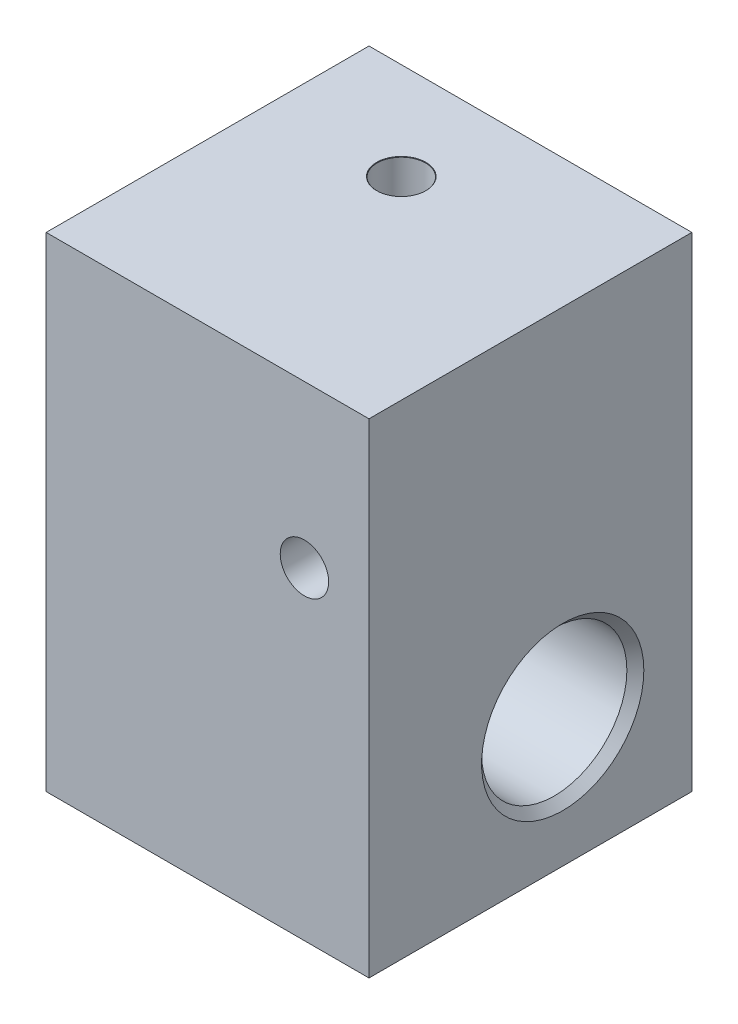
ISO-10303-21;
HEADER;
FILE_DESCRIPTION(('STEP AP214'),'2;1');
FILE_NAME('part.step','',(''),(''),'','','');
FILE_SCHEMA(('AUTOMOTIVE_DESIGN { 1 0 10303 214 1 1 1 1 }'));
ENDSEC;
DATA;
#1=APPLICATION_CONTEXT('core data for automotive mechanical design processes');
#2=APPLICATION_PROTOCOL_DEFINITION('international standard','automotive_design',2000,#1);
#3=PRODUCT_CONTEXT('',#1,'mechanical');
#4=PRODUCT('Part','Part','',(#3));
#5=PRODUCT_RELATED_PRODUCT_CATEGORY('part','',(#4));
#6=PRODUCT_DEFINITION_FORMATION('','',#4);
#7=PRODUCT_DEFINITION_CONTEXT('part definition',#1,'design');
#8=PRODUCT_DEFINITION('design','',#6,#7);
#9=PRODUCT_DEFINITION_SHAPE('','',#8);
#10=(LENGTH_UNIT() NAMED_UNIT(*) SI_UNIT(.MILLI.,.METRE.));
#11=(NAMED_UNIT(*) PLANE_ANGLE_UNIT() SI_UNIT($,.RADIAN.));
#12=(NAMED_UNIT(*) SI_UNIT($,.STERADIAN.) SOLID_ANGLE_UNIT());
#13=UNCERTAINTY_MEASURE_WITH_UNIT(LENGTH_MEASURE(1.E-05),#10,'distance_accuracy_value','');
#14=(GEOMETRIC_REPRESENTATION_CONTEXT(3) GLOBAL_UNCERTAINTY_ASSIGNED_CONTEXT((#13)) GLOBAL_UNIT_ASSIGNED_CONTEXT((#10,
#11,#12)) REPRESENTATION_CONTEXT('',''));
#15=CARTESIAN_POINT('',(0.,0.,0.));
#16=DIRECTION('',(0.,0.,1.));
#17=DIRECTION('',(1.,0.,0.));
#18=AXIS2_PLACEMENT_3D('',#15,#16,#17);
#19=CARTESIAN_POINT('',(0.,30.,-1.9004617207274));
#20=DIRECTION('',(1.,0.,0.));
#21=DIRECTION('',(0.,0.,-1.));
#22=AXIS2_PLACEMENT_3D('',#19,#20,#21);
#23=PLANE('',#22);
#24=CARTESIAN_POINT('',(0.,20.,10.0995382792726));
#25=DIRECTION('',(-1.,0.,0.));
#26=DIRECTION('',(0.,0.,1.));
#27=AXIS2_PLACEMENT_3D('',#24,#25,#26);
#28=CIRCLE('',#27,1.525);
#29=CARTESIAN_POINT('',(0.,20.,11.6245382792726));
#30=VERTEX_POINT('',#29);
#31=EDGE_CURVE('E116',#30,#30,#28,.T.);
#32=ORIENTED_EDGE('',*,*,#31,.F.);
#33=EDGE_LOOP('',(#32));
#34=FACE_BOUND('',#33,.T.);
#35=DIRECTION('',(0.,0.,1.));
#36=VECTOR('',#35,1.);
#37=CARTESIAN_POINT('',(0.,0.,-1.9004617207274));
#38=LINE('',#37,#36);
#39=CARTESIAN_POINT('',(0.,0.,-1.9004617207274));
#40=VERTEX_POINT('',#39);
#41=CARTESIAN_POINT('',(0.,0.,18.0995382792726));
#42=VERTEX_POINT('',#41);
#43=EDGE_CURVE('E134',#40,#42,#38,.T.);
#44=ORIENTED_EDGE('',*,*,#43,.T.);
#45=DIRECTION('',(0.,-1.,0.));
#46=VECTOR('',#45,1.);
#47=CARTESIAN_POINT('',(0.,30.,18.0995382792726));
#48=LINE('',#47,#46);
#49=CARTESIAN_POINT('',(0.,30.,18.0995382792726));
#50=VERTEX_POINT('',#49);
#51=EDGE_CURVE('E11',#50,#42,#48,.T.);
#52=ORIENTED_EDGE('',*,*,#51,.F.);
#53=DIRECTION('',(0.,0.,1.));
#54=VECTOR('',#53,1.);
#55=CARTESIAN_POINT('',(0.,30.,-1.9004617207274));
#56=LINE('',#55,#54);
#57=CARTESIAN_POINT('',(0.,30.,-1.9004617207274));
#58=VERTEX_POINT('',#57);
#59=EDGE_CURVE('E135',#58,#50,#56,.T.);
#60=ORIENTED_EDGE('',*,*,#59,.F.);
#61=DIRECTION('',(0.,-1.,0.));
#62=VECTOR('',#61,1.);
#63=CARTESIAN_POINT('',(0.,30.,-1.9004617207274));
#64=LINE('',#63,#62);
#65=EDGE_CURVE('E141',#58,#40,#64,.T.);
#66=ORIENTED_EDGE('',*,*,#65,.T.);
#67=EDGE_LOOP('',(#44,#52,#60,#66));
#68=FACE_BOUND('',#67,.T.);
#69=ADVANCED_FACE('F32',(#34,#68),#23,.F.);
#70=CARTESIAN_POINT('',(0.,30.,18.0995382792726));
#71=DIRECTION('',(0.,0.,-1.));
#72=DIRECTION('',(-1.,0.,0.));
#73=AXIS2_PLACEMENT_3D('',#70,#71,#72);
#74=PLANE('',#73);
#75=CARTESIAN_POINT('',(16.,20.,18.0995382792726));
#76=DIRECTION('',(0.,0.,-1.));
#77=DIRECTION('',(-1.,0.,0.));
#78=AXIS2_PLACEMENT_3D('',#75,#76,#77);
#79=CIRCLE('',#78,1.5);
#80=CARTESIAN_POINT('',(14.5,20.,18.0995382792726));
#81=VERTEX_POINT('',#80);
#82=EDGE_CURVE('E131',#81,#81,#79,.T.);
#83=ORIENTED_EDGE('',*,*,#82,.T.);
#84=EDGE_LOOP('',(#83));
#85=FACE_BOUND('',#84,.T.);
#86=DIRECTION('',(1.,0.,0.));
#87=VECTOR('',#86,1.);
#88=CARTESIAN_POINT('',(0.,0.,18.0995382792726));
#89=LINE('',#88,#87);
#90=CARTESIAN_POINT('',(20.,0.,18.0995382792726));
#91=VERTEX_POINT('',#90);
#92=EDGE_CURVE('E144',#42,#91,#89,.T.);
#93=ORIENTED_EDGE('',*,*,#92,.T.);
#94=DIRECTION('',(0.,-1.,0.));
#95=VECTOR('',#94,1.);
#96=CARTESIAN_POINT('',(20.,30.,18.0995382792726));
#97=LINE('',#96,#95);
#98=CARTESIAN_POINT('',(20.,30.,18.0995382792726));
#99=VERTEX_POINT('',#98);
#100=EDGE_CURVE('E46',#99,#91,#97,.T.);
#101=ORIENTED_EDGE('',*,*,#100,.F.);
#102=DIRECTION('',(1.,0.,0.));
#103=VECTOR('',#102,1.);
#104=CARTESIAN_POINT('',(0.,30.,18.0995382792726));
#105=LINE('',#104,#103);
#106=EDGE_CURVE('E85',#50,#99,#105,.T.);
#107=ORIENTED_EDGE('',*,*,#106,.F.);
#108=ORIENTED_EDGE('',*,*,#51,.T.);
#109=EDGE_LOOP('',(#93,#101,#107,#108));
#110=FACE_BOUND('',#109,.T.);
#111=ADVANCED_FACE('F170',(#85,#110),#74,.F.);
#112=CARTESIAN_POINT('',(20.,30.,-1.9004617207274));
#113=DIRECTION('',(-1.,0.,0.));
#114=DIRECTION('',(0.,0.,1.));
#115=AXIS2_PLACEMENT_3D('',#112,#113,#114);
#116=PLANE('',#115);
#117=CARTESIAN_POINT('',(20.,8.,6.0995382792726));
#118=DIRECTION('',(1.,0.,0.));
#119=DIRECTION('',(0.,0.,-1.));
#120=AXIS2_PLACEMENT_3D('',#117,#118,#119);
#121=CIRCLE('',#120,5.025);
#122=CARTESIAN_POINT('',(20.,8.,1.07453827927259));
#123=VERTEX_POINT('',#122);
#124=EDGE_CURVE('E107',#123,#123,#121,.T.);
#125=ORIENTED_EDGE('',*,*,#124,.F.);
#126=EDGE_LOOP('',(#125));
#127=FACE_BOUND('',#126,.T.);
#128=DIRECTION('',(0.,0.,-1.));
#129=VECTOR('',#128,1.);
#130=CARTESIAN_POINT('',(20.,0.,-1.9004617207274));
#131=LINE('',#130,#129);
#132=CARTESIAN_POINT('',(20.,0.,-1.9004617207274));
#133=VERTEX_POINT('',#132);
#134=EDGE_CURVE('E72',#91,#133,#131,.T.);
#135=ORIENTED_EDGE('',*,*,#134,.T.);
#136=DIRECTION('',(0.,-1.,0.));
#137=VECTOR('',#136,1.);
#138=CARTESIAN_POINT('',(20.,30.,-1.9004617207274));
#139=LINE('',#138,#137);
#140=CARTESIAN_POINT('',(20.,30.,-1.9004617207274));
#141=VERTEX_POINT('',#140);
#142=EDGE_CURVE('E149',#141,#133,#139,.T.);
#143=ORIENTED_EDGE('',*,*,#142,.F.);
#144=DIRECTION('',(0.,0.,-1.));
#145=VECTOR('',#144,1.);
#146=CARTESIAN_POINT('',(20.,30.,-1.9004617207274));
#147=LINE('',#146,#145);
#148=EDGE_CURVE('E138',#99,#141,#147,.T.);
#149=ORIENTED_EDGE('',*,*,#148,.F.);
#150=ORIENTED_EDGE('',*,*,#100,.T.);
#151=EDGE_LOOP('',(#135,#143,#149,#150));
#152=FACE_BOUND('',#151,.T.);
#153=ADVANCED_FACE('F152',(#127,#152),#116,.F.);
#154=CARTESIAN_POINT('',(0.,30.,-1.9004617207274));
#155=DIRECTION('',(0.,0.,1.));
#156=DIRECTION('',(1.,0.,0.));
#157=AXIS2_PLACEMENT_3D('',#154,#155,#156);
#158=PLANE('',#157);
#159=CARTESIAN_POINT('',(16.,20.,-1.90046172072741));
#160=DIRECTION('',(0.,0.,-1.));
#161=DIRECTION('',(-1.,0.,0.));
#162=AXIS2_PLACEMENT_3D('',#159,#160,#161);
#163=CIRCLE('',#162,1.525);
#164=CARTESIAN_POINT('',(14.475,20.,-1.90046172072741));
#165=VERTEX_POINT('',#164);
#166=EDGE_CURVE('E125',#165,#165,#163,.T.);
#167=ORIENTED_EDGE('',*,*,#166,.F.);
#168=EDGE_LOOP('',(#167));
#169=FACE_BOUND('',#168,.T.);
#170=DIRECTION('',(-1.,0.,0.));
#171=VECTOR('',#170,1.);
#172=CARTESIAN_POINT('',(0.,0.,-1.9004617207274));
#173=LINE('',#172,#171);
#174=EDGE_CURVE('E78',#133,#40,#173,.T.);
#175=ORIENTED_EDGE('',*,*,#174,.T.);
#176=ORIENTED_EDGE('',*,*,#65,.F.);
#177=DIRECTION('',(-1.,0.,0.));
#178=VECTOR('',#177,1.);
#179=CARTESIAN_POINT('',(0.,30.,-1.9004617207274));
#180=LINE('',#179,#178);
#181=EDGE_CURVE('E54',#141,#58,#180,.T.);
#182=ORIENTED_EDGE('',*,*,#181,.F.);
#183=ORIENTED_EDGE('',*,*,#142,.T.);
#184=EDGE_LOOP('',(#175,#176,#182,#183));
#185=FACE_BOUND('',#184,.T.);
#186=ADVANCED_FACE('F159',(#169,#185),#158,.F.);
#187=CARTESIAN_POINT('',(0.,30.,0.));
#188=DIRECTION('',(0.,1.,0.));
#189=DIRECTION('',(0.,0.,1.));
#190=AXIS2_PLACEMENT_3D('',#187,#188,#189);
#191=PLANE('',#190);
#192=CARTESIAN_POINT('',(8.,30.,4.0995382792726));
#193=DIRECTION('',(0.,1.,0.));
#194=DIRECTION('',(0.,0.,1.));
#195=AXIS2_PLACEMENT_3D('',#192,#193,#194);
#196=CIRCLE('',#195,1.525);
#197=CARTESIAN_POINT('',(8.,30.,5.6245382792726));
#198=VERTEX_POINT('',#197);
#199=EDGE_CURVE('E105',#198,#198,#196,.T.);
#200=ORIENTED_EDGE('',*,*,#199,.F.);
#201=EDGE_LOOP('',(#200));
#202=FACE_BOUND('',#201,.T.);
#203=ORIENTED_EDGE('',*,*,#59,.T.);
#204=ORIENTED_EDGE('',*,*,#106,.T.);
#205=ORIENTED_EDGE('',*,*,#148,.T.);
#206=ORIENTED_EDGE('',*,*,#181,.T.);
#207=EDGE_LOOP('',(#203,#204,#205,#206));
#208=FACE_BOUND('',#207,.T.);
#209=ADVANCED_FACE('F161',(#202,#208),#191,.T.);
#210=CARTESIAN_POINT('',(0.,0.,0.));
#211=DIRECTION('',(0.,1.,0.));
#212=DIRECTION('',(0.,0.,1.));
#213=AXIS2_PLACEMENT_3D('',#210,#211,#212);
#214=PLANE('',#213);
#215=ORIENTED_EDGE('',*,*,#43,.F.);
#216=ORIENTED_EDGE('',*,*,#174,.F.);
#217=ORIENTED_EDGE('',*,*,#134,.F.);
#218=ORIENTED_EDGE('',*,*,#92,.F.);
#219=EDGE_LOOP('',(#215,#216,#217,#218));
#220=FACE_BOUND('',#219,.T.);
#221=ADVANCED_FACE('F155',(#220),#214,.F.);
#222=CARTESIAN_POINT('',(16.,20.,-1.9004617207274));
#223=DIRECTION('',(0.,0.,-1.));
#224=DIRECTION('',(-1.,0.,0.));
#225=AXIS2_PLACEMENT_3D('',#222,#223,#224);
#226=CYLINDRICAL_SURFACE('',#225,1.5);
#227=ORIENTED_EDGE('',*,*,#82,.F.);
#228=EDGE_LOOP('',(#227));
#229=FACE_BOUND('',#228,.T.);
#230=CARTESIAN_POINT('',(16.,20.,-1.8754617207274));
#231=DIRECTION('',(0.,0.,-1.));
#232=DIRECTION('',(-1.,0.,0.));
#233=AXIS2_PLACEMENT_3D('',#230,#231,#232);
#234=CIRCLE('',#233,1.5);
#235=CARTESIAN_POINT('',(14.5,20.,-1.8754617207274));
#236=VERTEX_POINT('',#235);
#237=EDGE_CURVE('E128',#236,#236,#234,.T.);
#238=ORIENTED_EDGE('',*,*,#237,.T.);
#239=EDGE_LOOP('',(#238));
#240=FACE_BOUND('',#239,.T.);
#241=ADVANCED_FACE('F208',(#229,#240),#226,.F.);
#242=CARTESIAN_POINT('',(16.,20.,-1.90046172072741));
#243=DIRECTION('',(0.,0.,-1.));
#244=DIRECTION('',(-1.,0.,0.));
#245=AXIS2_PLACEMENT_3D('',#242,#243,#244);
#246=CONICAL_SURFACE('',#245,1.525,0.785398163397357);
#247=ORIENTED_EDGE('',*,*,#237,.F.);
#248=EDGE_LOOP('',(#247));
#249=FACE_BOUND('',#248,.T.);
#250=ORIENTED_EDGE('',*,*,#166,.T.);
#251=EDGE_LOOP('',(#250));
#252=FACE_BOUND('',#251,.T.);
#253=ADVANCED_FACE('F204',(#249,#252),#246,.F.);
#254=CARTESIAN_POINT('',(12.,20.,10.0995382792726));
#255=DIRECTION('',(-1.,0.,0.));
#256=DIRECTION('',(0.,0.,1.));
#257=AXIS2_PLACEMENT_3D('',#254,#255,#256);
#258=CONICAL_SURFACE('',#257,1.5,1.02974425867665);
#259=CARTESIAN_POINT('',(12.9012909285413,20.,10.0995382792726));
#260=VERTEX_POINT('',#259);
#261=VERTEX_LOOP('',#260);
#262=FACE_BOUND('',#261,.T.);
#263=CARTESIAN_POINT('',(12.,20.,10.0995382792726));
#264=DIRECTION('',(-1.,0.,0.));
#265=DIRECTION('',(0.,0.,1.));
#266=AXIS2_PLACEMENT_3D('',#263,#264,#265);
#267=CIRCLE('',#266,1.5);
#268=CARTESIAN_POINT('',(12.,20.,11.5995382792726));
#269=VERTEX_POINT('',#268);
#270=EDGE_CURVE('E122',#269,#269,#267,.T.);
#271=ORIENTED_EDGE('',*,*,#270,.T.);
#272=EDGE_LOOP('',(#271));
#273=FACE_BOUND('',#272,.T.);
#274=ADVANCED_FACE('F195',(#262,#273),#258,.F.);
#275=CARTESIAN_POINT('',(0.,20.,10.0995382792726));
#276=DIRECTION('',(-1.,0.,0.));
#277=DIRECTION('',(0.,0.,1.));
#278=AXIS2_PLACEMENT_3D('',#275,#276,#277);
#279=CYLINDRICAL_SURFACE('',#278,1.49999999999999);
#280=ORIENTED_EDGE('',*,*,#270,.F.);
#281=EDGE_LOOP('',(#280));
#282=FACE_BOUND('',#281,.T.);
#283=CARTESIAN_POINT('',(0.0250000000000124,20.,10.0995382792726));
#284=DIRECTION('',(-1.,0.,0.));
#285=DIRECTION('',(0.,0.,1.));
#286=AXIS2_PLACEMENT_3D('',#283,#284,#285);
#287=CIRCLE('',#286,1.49999999999999);
#288=CARTESIAN_POINT('',(0.0250000000000125,20.,11.5995382792726));
#289=VERTEX_POINT('',#288);
#290=EDGE_CURVE('E119',#289,#289,#287,.T.);
#291=ORIENTED_EDGE('',*,*,#290,.T.);
#292=EDGE_LOOP('',(#291));
#293=FACE_BOUND('',#292,.T.);
#294=ADVANCED_FACE('F186',(#282,#293),#279,.F.);
#295=CARTESIAN_POINT('',(0.,20.,10.0995382792726));
#296=DIRECTION('',(-1.,0.,0.));
#297=DIRECTION('',(0.,0.,1.));
#298=AXIS2_PLACEMENT_3D('',#295,#296,#297);
#299=CONICAL_SURFACE('',#298,1.525,0.785398163397414);
#300=ORIENTED_EDGE('',*,*,#290,.F.);
#301=EDGE_LOOP('',(#300));
#302=FACE_BOUND('',#301,.T.);
#303=ORIENTED_EDGE('',*,*,#31,.T.);
#304=EDGE_LOOP('',(#303));
#305=FACE_BOUND('',#304,.T.);
#306=ADVANCED_FACE('F183',(#302,#305),#299,.F.);
#307=CARTESIAN_POINT('',(8.,30.,4.0995382792726));
#308=DIRECTION('',(0.,1.,0.));
#309=DIRECTION('',(0.,0.,1.));
#310=AXIS2_PLACEMENT_3D('',#307,#308,#309);
#311=CYLINDRICAL_SURFACE('',#310,1.49999999999999);
#312=CARTESIAN_POINT('',(8.,12.4721359549996,5.59953827927258));
#313=CARTESIAN_POINT('',(7.91660474612497,12.4721374897967,5.59953468171094));
#314=CARTESIAN_POINT('',(7.83310158214307,12.4713722764732,5.59255522103359));
#315=CARTESIAN_POINT('',(7.66833120121543,12.4681368275641,5.56480306938219));
#316=CARTESIAN_POINT('',(7.58706899448924,12.4656630500406,5.54400172837386));
#317=CARTESIAN_POINT('',(7.42924396257842,12.4585049609598,5.48921664185374));
#318=CARTESIAN_POINT('',(7.35267890103656,12.4538217107305,5.45523922690869));
#319=CARTESIAN_POINT('',(7.20647374251181,12.4415014615554,5.37517898503824));
#320=CARTESIAN_POINT('',(7.13682999328285,12.4338660309346,5.32910258977373));
#321=CARTESIAN_POINT('',(7.00687413351858,12.4148432953305,5.22670177567263));
#322=CARTESIAN_POINT('',(6.94650299024569,12.4034813041766,5.17044761767187));
#323=CARTESIAN_POINT('',(6.83621974614194,12.3762006532261,5.04944103916348));
#324=CARTESIAN_POINT('',(6.78630678265046,12.3602823695196,4.98468932030866));
#325=CARTESIAN_POINT('',(6.69860456959045,12.3235171132845,4.84972505648165));
#326=CARTESIAN_POINT('',(6.66069424421065,12.3027233048777,4.77957654589637));
#327=CARTESIAN_POINT('',(6.59687712900855,12.2559171602169,4.63567649205098));
#328=CARTESIAN_POINT('',(6.57097078731713,12.2299046291903,4.56192481439159));
#329=CARTESIAN_POINT('',(6.53064586187609,12.1721299355647,4.41134659027188));
#330=CARTESIAN_POINT('',(6.51652598235153,12.140241923947,4.33448905225095));
#331=CARTESIAN_POINT('',(6.50027622206906,12.0717004771356,4.18165362006912));
#332=CARTESIAN_POINT('',(6.49815135627429,12.0350450552992,4.10567610708142));
#333=CARTESIAN_POINT('',(6.50531066195152,11.9540187291887,3.94913640285375));
#334=CARTESIAN_POINT('',(6.51571205581429,11.9092448204257,3.868836302171));
#335=CARTESIAN_POINT('',(6.54847935348241,11.8160885266045,3.71296566158689));
#336=CARTESIAN_POINT('',(6.57084760530466,11.7677054349923,3.63739605310674));
#337=CARTESIAN_POINT('',(6.63066070404919,11.6608528345316,3.48066604117342));
#338=CARTESIAN_POINT('',(6.66991088046487,11.6019858989318,3.40046751312403));
#339=CARTESIAN_POINT('',(6.76153833030939,11.4830216515266,3.24859390531549));
#340=CARTESIAN_POINT('',(6.81394739471934,11.4229216884713,3.17694009648021));
#341=CARTESIAN_POINT('',(6.90586683785647,11.3298397126415,3.07220429177449));
#342=CARTESIAN_POINT('',(6.94117302542025,11.2963554965303,3.03582844742293));
#343=CARTESIAN_POINT('',(7.01581582263762,11.2304488957072,2.96640823601608));
#344=CARTESIAN_POINT('',(7.05515418083326,11.1980269797707,2.9333653267093));
#345=CARTESIAN_POINT('',(7.17909266732209,11.1035793001581,2.83985782208166));
#346=CARTESIAN_POINT('',(7.26995678996081,11.0440114554626,2.78461903710443));
#347=CARTESIAN_POINT('',(7.4209681593321,10.9654241548207,2.71462958739343));
#348=CARTESIAN_POINT('',(7.47504680284198,10.9406300283087,2.69314464622682));
#349=CARTESIAN_POINT('',(7.58757066237641,10.8972078108096,2.65613998856798));
#350=CARTESIAN_POINT('',(7.64600969748536,10.8785711876317,2.64061201291077));
#351=CARTESIAN_POINT('',(7.76705804543873,10.8492809352928,2.616439594867));
#352=CARTESIAN_POINT('',(7.82970787669383,10.8387224367766,2.60787710827298));
#353=CARTESIAN_POINT('',(7.95645720433171,10.8275611853007,2.59883004529655));
#354=CARTESIAN_POINT('',(8.02055510923501,10.8269479888177,2.59833699522508));
#355=CARTESIAN_POINT('',(8.13852997085462,10.8351100163227,2.6049477147446));
#356=CARTESIAN_POINT('',(8.19256865818224,10.842567720575,2.6109853252986));
#357=CARTESIAN_POINT('',(8.29841704394242,10.8639786272129,2.62854176626166));
#358=CARTESIAN_POINT('',(8.35022485760814,10.877937208675,2.64006513597472));
#359=CARTESIAN_POINT('',(8.47019887854876,10.9174992439461,2.67330303528733));
#360=CARTESIAN_POINT('',(8.53694485130388,10.9455184056562,2.69723525526089));
#361=CARTESIAN_POINT('',(8.66381544721871,11.0083137461781,2.75262781277621));
#362=CARTESIAN_POINT('',(8.72392258788106,11.043107128987,2.7841073658553));
#363=CARTESIAN_POINT('',(8.86261746092048,11.1331493122543,2.8686470203675));
#364=CARTESIAN_POINT('',(8.93766462132611,11.1906520581967,2.92510182250256));
#365=CARTESIAN_POINT('',(9.07462657668993,11.3092871436318,3.04896144532893));
#366=CARTESIAN_POINT('',(9.13652620447345,11.3704235720942,3.1163787559888));
#367=CARTESIAN_POINT('',(9.24852438252453,11.4947318975039,3.26293435894639));
#368=CARTESIAN_POINT('',(9.29826775214591,11.5579148822873,3.34233536360415));
#369=CARTESIAN_POINT('',(9.38263475895837,11.6819836651395,3.51035278263642));
#370=CARTESIAN_POINT('',(9.41727391476069,11.7428717619998,3.59895962211428));
#371=CARTESIAN_POINT('',(9.4667015522204,11.8536286393678,3.77380108443161));
#372=CARTESIAN_POINT('',(9.48324938109613,11.9039737765046,3.85923161470478));
#373=CARTESIAN_POINT('',(9.50117541847965,11.9994675233626,4.03454406796946));
#374=CARTESIAN_POINT('',(9.50255816340492,12.0446176830877,4.12442465170938));
#375=CARTESIAN_POINT('',(9.48845806086955,12.1286404119755,4.30664812989977));
#376=CARTESIAN_POINT('',(9.4728565920629,12.1674666232705,4.39900389155587));
#377=CARTESIAN_POINT('',(9.42351056506371,12.2374459382706,4.58177422558694));
#378=CARTESIAN_POINT('',(9.38978026124101,12.2686050424581,4.67219026512388));
#379=CARTESIAN_POINT('',(9.30975625430468,12.3195808797002,4.8355692266351));
#380=CARTESIAN_POINT('',(9.26559871320591,12.3403349719895,4.90929126579393));
#381=CARTESIAN_POINT('',(9.16451276810194,12.3762312634984,5.04892093184656));
#382=CARTESIAN_POINT('',(9.10758963709318,12.3913757730013,5.11483176812874));
#383=CARTESIAN_POINT('',(8.98660514844558,12.4160368724952,5.23235499279734));
#384=CARTESIAN_POINT('',(8.9232237215984,12.4258490264561,5.28460837393795));
#385=CARTESIAN_POINT('',(8.78844972702974,12.4420709379683,5.37824049627844));
#386=CARTESIAN_POINT('',(8.71705384732891,12.4484792825759,5.4196147178743));
#387=CARTESIAN_POINT('',(8.56815364387588,12.4587015683295,5.4902258961958));
#388=CARTESIAN_POINT('',(8.49063650532854,12.462509896612,5.51943654178048));
#389=CARTESIAN_POINT('',(8.33189318774898,12.4681597301692,5.56467813977044));
#390=CARTESIAN_POINT('',(8.25067467373531,12.4700051231914,5.58073512946267));
#391=CARTESIAN_POINT('',(8.14076534305634,12.4714217431686,5.59318607646764));
#392=CARTESIAN_POINT('',(8.11266903612298,12.471690402386,5.59556639828857));
#393=CARTESIAN_POINT('',(8.05638593227276,12.4720472489448,5.59874310907056));
#394=CARTESIAN_POINT('',(8.0281991352254,12.4721354360258,5.59953949574621));
#395=CARTESIAN_POINT('',(8.,12.4721359549996,5.59953827927258));
#396=B_SPLINE_CURVE_WITH_KNOTS('',3,(#312,#313,#314,#315,#316,#317,#318,#319,#320,#321,#322,
#323,#324,#325,#326,#327,#328,#329,#330,#331,#332,#333,#334,#335,#336,#337,#338,#339,#340,#341,
#342,#343,#344,#345,#346,#347,#348,#349,#350,#351,#352,#353,#354,#355,#356,#357,#358,#359,#360,
#361,#362,#363,#364,#365,#366,#367,#368,#369,#370,#371,#372,#373,#374,#375,#376,#377,#378,#379,
#380,#381,#382,#383,#384,#385,#386,#387,#388,#389,#390,#391,#392,#393,#394,#395),.UNSPECIFIED.,
.T.,.F.,(4,2,2,2,2,2,2,2,2,2,2,2,2,2,2,2,2,2,2,2,2,2,2,2,2,2,2,2,2,2,2,2,2,2,2,2,2,2,2,2,2,4),
(0.,0.250079650346902,0.500679290332136,0.75115867627817,1.00150517924684,1.25018517538769,
1.49884465065624,1.74490936788148,1.99098327041727,2.24311884079617,2.49535981805708,
2.77186656009302,3.04842757541803,3.36805479289971,3.68846176598536,3.87049613355681,
4.05260977661294,4.41495804189742,4.60416663365034,4.79311193666448,4.98424945806323,
5.17518625367905,5.33907781378372,5.50310522567427,5.73055405333123,5.95858823367806,
6.28719087616864,6.61617056466548,6.95384602656611,7.29117372637307,7.59153569247187,
7.89180780714229,8.19419061951235,8.49633602091867,8.76015795319239,9.02387111038012,
9.27089129234213,9.51801393403792,9.76566838644036,10.0128314212005,10.0973928245722,
10.1819543499537),.UNSPECIFIED.);
#397=CARTESIAN_POINT('',(8.,12.4721359549996,5.59953827927258));
#398=VERTEX_POINT('',#397);
#399=EDGE_CURVE('E35',#398,#398,#396,.T.);
#400=ORIENTED_EDGE('',*,*,#399,.T.);
#401=EDGE_LOOP('',(#400));
#402=FACE_BOUND('',#401,.T.);
#403=CARTESIAN_POINT('',(8.,29.975,4.0995382792726));
#404=DIRECTION('',(0.,1.,0.));
#405=DIRECTION('',(0.,0.,1.));
#406=AXIS2_PLACEMENT_3D('',#403,#404,#405);
#407=CIRCLE('',#406,1.49999999999999);
#408=CARTESIAN_POINT('',(8.,29.975,5.59953827927259));
#409=VERTEX_POINT('',#408);
#410=EDGE_CURVE('E113',#409,#409,#407,.T.);
#411=ORIENTED_EDGE('',*,*,#410,.T.);
#412=EDGE_LOOP('',(#411));
#413=FACE_BOUND('',#412,.T.);
#414=ADVANCED_FACE('F185',(#402,#413),#311,.F.);
#415=CARTESIAN_POINT('',(8.,30.,4.0995382792726));
#416=DIRECTION('',(0.,1.,0.));
#417=DIRECTION('',(0.,0.,1.));
#418=AXIS2_PLACEMENT_3D('',#415,#416,#417);
#419=CONICAL_SURFACE('',#418,1.525,0.785398163397379);
#420=ORIENTED_EDGE('',*,*,#410,.F.);
#421=EDGE_LOOP('',(#420));
#422=FACE_BOUND('',#421,.T.);
#423=ORIENTED_EDGE('',*,*,#199,.T.);
#424=EDGE_LOOP('',(#423));
#425=FACE_BOUND('',#424,.T.);
#426=ADVANCED_FACE('F193',(#422,#425),#419,.F.);
#427=CARTESIAN_POINT('',(20.,8.,6.0995382792726));
#428=DIRECTION('',(1.,0.,0.));
#429=DIRECTION('',(0.,0.,-1.));
#430=AXIS2_PLACEMENT_3D('',#427,#428,#429);
#431=CYLINDRICAL_SURFACE('',#430,4.5);
#432=CARTESIAN_POINT('',(19.475,8.,6.0995382792726));
#433=DIRECTION('',(1.,0.,0.));
#434=DIRECTION('',(0.,0.,-1.));
#435=AXIS2_PLACEMENT_3D('',#432,#433,#434);
#436=CIRCLE('',#435,4.5);
#437=CARTESIAN_POINT('',(19.475,8.,1.5995382792726));
#438=VERTEX_POINT('',#437);
#439=EDGE_CURVE('E102',#438,#438,#436,.T.);
#440=ORIENTED_EDGE('',*,*,#439,.T.);
#441=EDGE_LOOP('',(#440));
#442=FACE_BOUND('',#441,.T.);
#443=CARTESIAN_POINT('',(3.,8.,6.0995382792726));
#444=DIRECTION('',(1.,0.,0.));
#445=DIRECTION('',(0.,0.,-1.));
#446=AXIS2_PLACEMENT_3D('',#443,#444,#445);
#447=CIRCLE('',#446,4.5);
#448=CARTESIAN_POINT('',(3.,8.,1.5995382792726));
#449=VERTEX_POINT('',#448);
#450=EDGE_CURVE('E100',#449,#449,#447,.T.);
#451=ORIENTED_EDGE('',*,*,#450,.F.);
#452=EDGE_LOOP('',(#451));
#453=FACE_BOUND('',#452,.T.);
#454=ORIENTED_EDGE('',*,*,#399,.F.);
#455=EDGE_LOOP('',(#454));
#456=FACE_BOUND('',#455,.T.);
#457=ADVANCED_FACE('F96',(#442,#453,#456),#431,.F.);
#458=CARTESIAN_POINT('',(3.,8.,6.0995382792726));
#459=DIRECTION('',(1.,0.,0.));
#460=DIRECTION('',(0.,0.,-1.));
#461=AXIS2_PLACEMENT_3D('',#458,#459,#460);
#462=CONICAL_SURFACE('',#461,4.5,1.02974425867665);
#463=CARTESIAN_POINT('',(0.296127214375979,7.99999999999999,6.0995382792726));
#464=VERTEX_POINT('',#463);
#465=VERTEX_LOOP('',#464);
#466=FACE_BOUND('',#465,.T.);
#467=ORIENTED_EDGE('',*,*,#450,.T.);
#468=EDGE_LOOP('',(#467));
#469=FACE_BOUND('',#468,.T.);
#470=ADVANCED_FACE('F92',(#466,#469),#462,.F.);
#471=CARTESIAN_POINT('',(20.,8.,6.0995382792726));
#472=DIRECTION('',(1.,0.,0.));
#473=DIRECTION('',(0.,0.,-1.));
#474=AXIS2_PLACEMENT_3D('',#471,#472,#473);
#475=CONICAL_SURFACE('',#474,5.025,0.785398163397448);
#476=ORIENTED_EDGE('',*,*,#439,.F.);
#477=EDGE_LOOP('',(#476));
#478=FACE_BOUND('',#477,.T.);
#479=ORIENTED_EDGE('',*,*,#124,.T.);
#480=EDGE_LOOP('',(#479));
#481=FACE_BOUND('',#480,.T.);
#482=ADVANCED_FACE('F95',(#478,#481),#475,.F.);
#483=CLOSED_SHELL('',(#69,#111,#153,#186,#209,#221,#241,#253,#274,#294,#306,#414,#426,#457,#470,#482));
#484=MANIFOLD_SOLID_BREP('B2',#483);
#485=ADVANCED_BREP_SHAPE_REPRESENTATION('',(#18,#484),#14);
#486=SHAPE_DEFINITION_REPRESENTATION(#9,#485);
ENDSEC;
END-ISO-10303-21;
